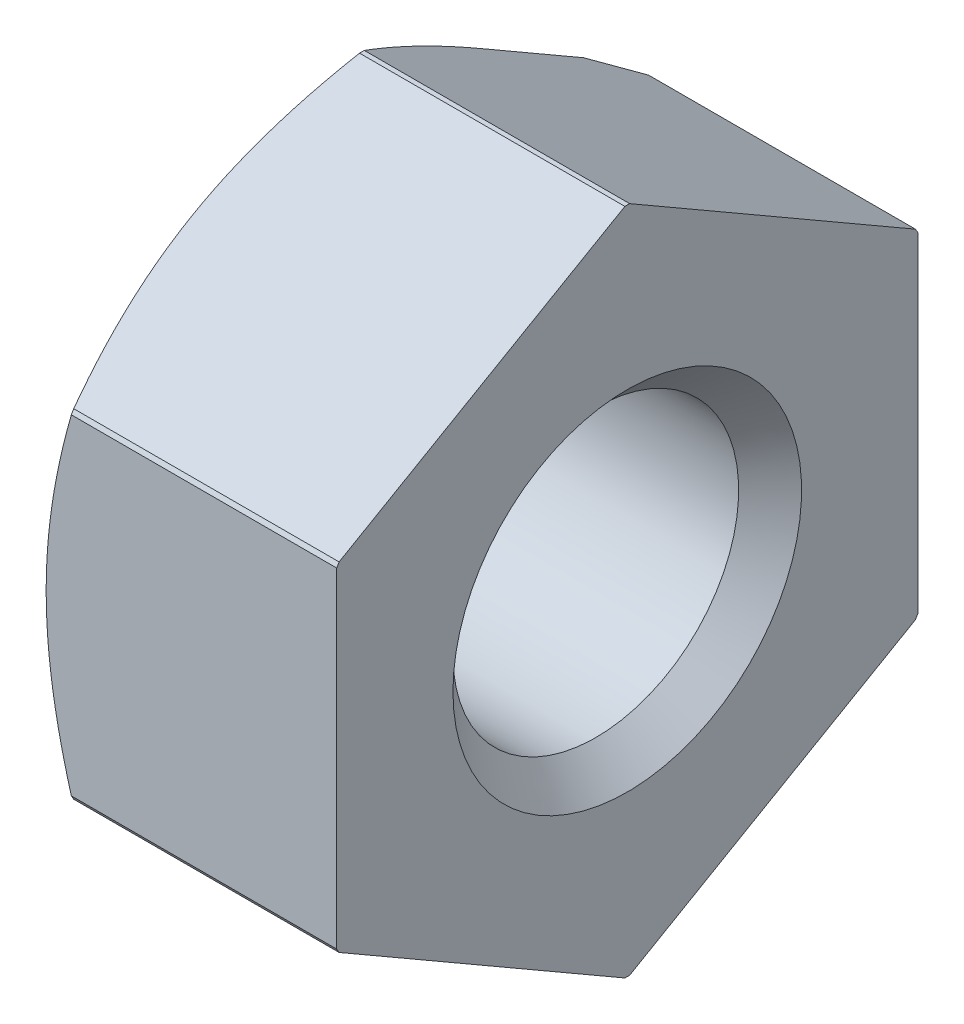
ISO-10303-21;
HEADER;
FILE_DESCRIPTION(('STEP AP214'),'2;1');
FILE_NAME('part.step','',(''),(''),'','','');
FILE_SCHEMA(('AUTOMOTIVE_DESIGN { 1 0 10303 214 1 1 1 1 }'));
ENDSEC;
DATA;
#1=APPLICATION_CONTEXT('core data for automotive mechanical design processes');
#2=APPLICATION_PROTOCOL_DEFINITION('international standard','automotive_design',2000,#1);
#3=PRODUCT_CONTEXT('',#1,'mechanical');
#4=PRODUCT('Part','Part','',(#3));
#5=PRODUCT_RELATED_PRODUCT_CATEGORY('part','',(#4));
#6=PRODUCT_DEFINITION_FORMATION('','',#4);
#7=PRODUCT_DEFINITION_CONTEXT('part definition',#1,'design');
#8=PRODUCT_DEFINITION('design','',#6,#7);
#9=PRODUCT_DEFINITION_SHAPE('','',#8);
#10=(LENGTH_UNIT() NAMED_UNIT(*) SI_UNIT(.MILLI.,.METRE.));
#11=(NAMED_UNIT(*) PLANE_ANGLE_UNIT() SI_UNIT($,.RADIAN.));
#12=(NAMED_UNIT(*) SI_UNIT($,.STERADIAN.) SOLID_ANGLE_UNIT());
#13=UNCERTAINTY_MEASURE_WITH_UNIT(LENGTH_MEASURE(1.E-05),#10,'distance_accuracy_value','');
#14=(GEOMETRIC_REPRESENTATION_CONTEXT(3) GLOBAL_UNCERTAINTY_ASSIGNED_CONTEXT((#13)) GLOBAL_UNIT_ASSIGNED_CONTEXT((#10,
#11,#12)) REPRESENTATION_CONTEXT('',''));
#15=CARTESIAN_POINT('',(0.,0.,0.));
#16=DIRECTION('',(0.,0.,1.));
#17=DIRECTION('',(1.,0.,0.));
#18=AXIS2_PLACEMENT_3D('',#15,#16,#17);
#19=CARTESIAN_POINT('',(2.5,0.,0.));
#20=DIRECTION('',(-1.,0.,0.));
#21=DIRECTION('',(0.,0.,1.));
#22=AXIS2_PLACEMENT_3D('',#19,#20,#21);
#23=CYLINDRICAL_SURFACE('',#22,5.75);
#24=DIRECTION('',(-1.,0.,0.));
#25=VECTOR('',#24,1.);
#26=CARTESIAN_POINT('',(2.5,-5.74985410537226,0.0409605533867544));
#27=LINE('',#26,#25);
#28=CARTESIAN_POINT('',(2.5,-5.74985410537226,0.0409605533867544));
#29=VERTEX_POINT('',#28);
#30=CARTESIAN_POINT('',(-2.06698729806814,-5.74985410537226,0.0409605533867544));
#31=VERTEX_POINT('',#30);
#32=EDGE_CURVE('E145',#29,#31,#27,.T.);
#33=ORIENTED_EDGE('',*,*,#32,.T.);
#34=CARTESIAN_POINT('',(-2.06698729806814,0.,0.));
#35=DIRECTION('',(-1.,0.,0.));
#36=DIRECTION('',(0.,0.,1.));
#37=AXIS2_PLACEMENT_3D('',#34,#35,#36);
#38=CIRCLE('',#37,5.75);
#39=CARTESIAN_POINT('',(-2.06698729806814,-5.74985410537226,-0.0409605533867514));
#40=VERTEX_POINT('',#39);
#41=EDGE_CURVE('E583',#31,#40,#38,.F.);
#42=ORIENTED_EDGE('',*,*,#41,.T.);
#43=DIRECTION('',(-1.,0.,0.));
#44=VECTOR('',#43,1.);
#45=CARTESIAN_POINT('',(2.5,-5.74985410537226,-0.0409605533867514));
#46=LINE('',#45,#44);
#47=CARTESIAN_POINT('',(2.5,-5.74985410537226,-0.0409605533867514));
#48=VERTEX_POINT('',#47);
#49=EDGE_CURVE('E170',#48,#40,#46,.T.);
#50=ORIENTED_EDGE('',*,*,#49,.F.);
#51=CARTESIAN_POINT('',(2.5,0.,0.));
#52=DIRECTION('',(-1.,0.,0.));
#53=DIRECTION('',(0.,0.,1.));
#54=AXIS2_PLACEMENT_3D('',#51,#52,#53);
#55=CIRCLE('',#54,5.75);
#56=EDGE_CURVE('E163',#48,#29,#55,.T.);
#57=ORIENTED_EDGE('',*,*,#56,.T.);
#58=EDGE_LOOP('',(#33,#42,#50,#57));
#59=FACE_BOUND('',#58,.T.);
#60=ADVANCED_FACE('F34',(#59),#23,.T.);
#61=CARTESIAN_POINT('',(2.5,-2.91039993247213,-4.95903944661325));
#62=DIRECTION('',(0.,-0.866025403784439,-0.5));
#63=DIRECTION('',(0.,0.5,-0.866025403784439));
#64=AXIS2_PLACEMENT_3D('',#61,#62,#63);
#65=PLANE('',#64);
#66=ORIENTED_EDGE('',*,*,#49,.T.);
#67=CARTESIAN_POINT('',(-2.06698729806814,-5.74985410537226,-0.0409605533867514));
#68=CARTESIAN_POINT('',(-2.13293926760584,-5.63422830061158,-0.241230321898287));
#69=CARTESIAN_POINT('',(-2.1932936171313,-5.51769112685617,-0.443078627813147));
#70=CARTESIAN_POINT('',(-2.29964864457212,-5.28360943261849,-0.848520015354616));
#71=CARTESIAN_POINT('',(-2.34571867458539,-5.16607271946542,-1.05209957429037));
#72=CARTESIAN_POINT('',(-2.4022437103581,-4.98869063027668,-1.35933436511798));
#73=CARTESIAN_POINT('',(-2.41899522891897,-4.92934645363163,-1.46212149420056));
#74=CARTESIAN_POINT('',(-2.44798386711932,-4.81038233656533,-1.66817338923695));
#75=CARTESIAN_POINT('',(-2.46022109462101,-4.75076240276736,-1.77143814371893));
#76=CARTESIAN_POINT('',(-2.47997267715725,-4.6310314761332,-1.97881819188661));
#77=CARTESIAN_POINT('',(-2.48746357893235,-4.57091950891741,-2.08293517324727));
#78=CARTESIAN_POINT('',(-2.49748725573861,-4.45058161989342,-2.2913665111124));
#79=CARTESIAN_POINT('',(-2.50001911227568,-4.39035567904276,-2.39568090059938));
#80=CARTESIAN_POINT('',(-2.49999999997852,-4.33012701891913,-2.5000000000053));
#81=B_SPLINE_CURVE_WITH_KNOTS('',3,(#67,#68,#69,#70,#71,#72,#73,#74,#75,#76,#77,#78,#79,#80),
.UNSPECIFIED.,.F.,.F.,(4,2,2,2,2,2,4),(0.,0.721695148162265,1.43982943305717,1.79934484275083,
2.15885166180701,2.52012135362396,2.88145795201162),.UNSPECIFIED.);
#82=CARTESIAN_POINT('',(-2.5,-4.33012701892219,-2.5));
#83=VERTEX_POINT('',#82);
#84=EDGE_CURVE('E317',#40,#83,#81,.T.);
#85=ORIENTED_EDGE('',*,*,#84,.T.);
#86=CARTESIAN_POINT('',(-2.5,-4.33012701888997,-2.4999999999814));
#87=CARTESIAN_POINT('',(-2.50001911228332,-4.26989835878741,-2.60431909939853));
#88=CARTESIAN_POINT('',(-2.49748725574054,-4.20967241794555,-2.70863348888983));
#89=CARTESIAN_POINT('',(-2.48746357893007,-4.08933452892827,-2.91706482675766));
#90=CARTESIAN_POINT('',(-2.47997267715647,-4.02922256171039,-3.02118180811669));
#91=CARTESIAN_POINT('',(-2.4602210946213,-3.90949163507487,-3.2285618562829));
#92=CARTESIAN_POINT('',(-2.4479838671192,-3.84987170127761,-3.33182661076503));
#93=CARTESIAN_POINT('',(-2.41899522891855,-3.73090758421201,-3.53787850580126));
#94=CARTESIAN_POINT('',(-2.40224371035779,-3.67156340756695,-3.64066563488352));
#95=CARTESIAN_POINT('',(-2.34571867458525,-3.49418131837815,-3.94790042571067));
#96=CARTESIAN_POINT('',(-2.29964864457193,-3.37664460522522,-4.15147998464637));
#97=CARTESIAN_POINT('',(-2.19329361713106,-3.14256291098795,-4.55692137218752));
#98=CARTESIAN_POINT('',(-2.13293926760562,-3.0260257372328,-4.75876967810211));
#99=CARTESIAN_POINT('',(-2.06698729806814,-2.91039993247213,-4.95903944661325));
#100=B_SPLINE_CURVE_WITH_KNOTS('',3,(#86,#87,#88,#89,#90,#91,#92,#93,#94,#95,#96,#97,#98,#99),
.UNSPECIFIED.,.F.,.F.,(4,2,2,2,2,2,4),(0.,0.361336598386039,0.72260629020182,1.08211310925735,
1.44162851895021,2.15976280384478,2.88145795200594),.UNSPECIFIED.);
#101=CARTESIAN_POINT('',(-2.06698729806814,-2.91039993247213,-4.95903944661325));
#102=VERTEX_POINT('',#101);
#103=EDGE_CURVE('E324',#83,#102,#100,.T.);
#104=ORIENTED_EDGE('',*,*,#103,.T.);
#105=DIRECTION('',(-1.,0.,0.));
#106=VECTOR('',#105,1.);
#107=CARTESIAN_POINT('',(2.5,-2.91039993247213,-4.95903944661325));
#108=LINE('',#107,#106);
#109=CARTESIAN_POINT('',(2.5,-2.91039993247213,-4.95903944661325));
#110=VERTEX_POINT('',#109);
#111=EDGE_CURVE('E205',#110,#102,#108,.T.);
#112=ORIENTED_EDGE('',*,*,#111,.F.);
#113=DIRECTION('',(0.,-0.5,0.866025403784439));
#114=VECTOR('',#113,1.);
#115=CARTESIAN_POINT('',(2.5,-2.91039993247213,-4.95903944661325));
#116=LINE('',#115,#114);
#117=EDGE_CURVE('E156',#110,#48,#116,.T.);
#118=ORIENTED_EDGE('',*,*,#117,.T.);
#119=EDGE_LOOP('',(#66,#85,#104,#112,#118));
#120=FACE_BOUND('',#119,.T.);
#121=ADVANCED_FACE('F299',(#120),#65,.T.);
#122=CARTESIAN_POINT('',(2.5,0.,0.));
#123=DIRECTION('',(-1.,0.,0.));
#124=DIRECTION('',(0.,0.,1.));
#125=AXIS2_PLACEMENT_3D('',#122,#123,#124);
#126=CYLINDRICAL_SURFACE('',#125,5.75);
#127=ORIENTED_EDGE('',*,*,#111,.T.);
#128=CARTESIAN_POINT('',(-2.06698729806814,0.,0.));
#129=DIRECTION('',(-1.,0.,0.));
#130=DIRECTION('',(0.,0.,1.));
#131=AXIS2_PLACEMENT_3D('',#128,#129,#130);
#132=CIRCLE('',#131,5.75);
#133=CARTESIAN_POINT('',(-2.06698729806814,-2.83945417290014,-5.));
#134=VERTEX_POINT('',#133);
#135=EDGE_CURVE('E389',#102,#134,#132,.F.);
#136=ORIENTED_EDGE('',*,*,#135,.T.);
#137=DIRECTION('',(-1.,0.,0.));
#138=VECTOR('',#137,1.);
#139=CARTESIAN_POINT('',(2.5,-2.83945417290014,-5.));
#140=LINE('',#139,#138);
#141=CARTESIAN_POINT('',(2.5,-2.83945417290014,-5.));
#142=VERTEX_POINT('',#141);
#143=EDGE_CURVE('E208',#142,#134,#140,.T.);
#144=ORIENTED_EDGE('',*,*,#143,.F.);
#145=CARTESIAN_POINT('',(2.5,0.,0.));
#146=DIRECTION('',(-1.,0.,0.));
#147=DIRECTION('',(0.,0.,1.));
#148=AXIS2_PLACEMENT_3D('',#145,#146,#147);
#149=CIRCLE('',#148,5.75);
#150=EDGE_CURVE('E199',#142,#110,#149,.T.);
#151=ORIENTED_EDGE('',*,*,#150,.T.);
#152=EDGE_LOOP('',(#127,#136,#144,#151));
#153=FACE_BOUND('',#152,.T.);
#154=ADVANCED_FACE('F303',(#153),#126,.T.);
#155=CARTESIAN_POINT('',(2.5,2.83945417290014,-5.));
#156=DIRECTION('',(0.,0.,-1.));
#157=DIRECTION('',(-1.,0.,0.));
#158=AXIS2_PLACEMENT_3D('',#155,#156,#157);
#159=PLANE('',#158);
#160=ORIENTED_EDGE('',*,*,#143,.T.);
#161=DIRECTION('',(0.,1.,0.));
#162=VECTOR('',#161,1.);
#163=CARTESIAN_POINT('',(-2.06698729806814,2.83945417290014,-5.));
#164=LINE('',#163,#162);
#165=CARTESIAN_POINT('',(-2.06698729806814,2.83945417290014,-5.));
#166=VERTEX_POINT('',#165);
#167=EDGE_CURVE('E386',#134,#166,#164,.T.);
#168=ORIENTED_EDGE('',*,*,#167,.T.);
#169=DIRECTION('',(-1.,0.,0.));
#170=VECTOR('',#169,1.);
#171=CARTESIAN_POINT('',(2.5,2.83945417290014,-5.));
#172=LINE('',#171,#170);
#173=CARTESIAN_POINT('',(2.5,2.83945417290014,-5.));
#174=VERTEX_POINT('',#173);
#175=EDGE_CURVE('E211',#174,#166,#172,.T.);
#176=ORIENTED_EDGE('',*,*,#175,.F.);
#177=DIRECTION('',(0.,-1.,0.));
#178=VECTOR('',#177,1.);
#179=CARTESIAN_POINT('',(2.5,2.83945417290014,-5.));
#180=LINE('',#179,#178);
#181=EDGE_CURVE('E196',#174,#142,#180,.T.);
#182=ORIENTED_EDGE('',*,*,#181,.T.);
#183=EDGE_LOOP('',(#160,#168,#176,#182));
#184=FACE_BOUND('',#183,.T.);
#185=ADVANCED_FACE('F337',(#184),#159,.T.);
#186=CARTESIAN_POINT('',(2.5,0.,0.));
#187=DIRECTION('',(-1.,0.,0.));
#188=DIRECTION('',(0.,0.,1.));
#189=AXIS2_PLACEMENT_3D('',#186,#187,#188);
#190=CYLINDRICAL_SURFACE('',#189,5.75);
#191=ORIENTED_EDGE('',*,*,#175,.T.);
#192=CARTESIAN_POINT('',(-4.95373864413737,0.,0.));
#193=DIRECTION('',(0.866025403775356,0.,0.500000000015732));
#194=DIRECTION('',(-0.500000000015732,0.,0.866025403775356));
#195=AXIS2_PLACEMENT_3D('',#192,#193,#194);
#196=ELLIPSE('',#195,6.63952809575033,5.75);
#197=CARTESIAN_POINT('',(-2.09063588459313,2.91039993247213,-4.95903944661325));
#198=VERTEX_POINT('',#197);
#199=EDGE_CURVE('E387',#166,#198,#196,.T.);
#200=ORIENTED_EDGE('',*,*,#199,.T.);
#201=DIRECTION('',(-1.,0.,0.));
#202=VECTOR('',#201,1.);
#203=CARTESIAN_POINT('',(2.5,2.91039993247213,-4.95903944661325));
#204=LINE('',#203,#202);
#205=CARTESIAN_POINT('',(2.5,2.91039993247213,-4.95903944661325));
#206=VERTEX_POINT('',#205);
#207=EDGE_CURVE('E214',#206,#198,#204,.T.);
#208=ORIENTED_EDGE('',*,*,#207,.F.);
#209=CARTESIAN_POINT('',(2.5,0.,0.));
#210=DIRECTION('',(-1.,0.,0.));
#211=DIRECTION('',(0.,0.,1.));
#212=AXIS2_PLACEMENT_3D('',#209,#210,#211);
#213=CIRCLE('',#212,5.75);
#214=EDGE_CURVE('E193',#206,#174,#213,.T.);
#215=ORIENTED_EDGE('',*,*,#214,.T.);
#216=EDGE_LOOP('',(#191,#200,#208,#215));
#217=FACE_BOUND('',#216,.T.);
#218=ADVANCED_FACE('F341',(#217),#190,.T.);
#219=CARTESIAN_POINT('',(2.5,5.74985410537226,-0.0409605533867555));
#220=DIRECTION('',(0.,0.866025403784439,-0.5));
#221=DIRECTION('',(0.,0.5,0.866025403784439));
#222=AXIS2_PLACEMENT_3D('',#219,#220,#221);
#223=PLANE('',#222);
#224=DIRECTION('',(0.,-0.5,-0.866025403784439));
#225=VECTOR('',#224,1.);
#226=CARTESIAN_POINT('',(-2.5,5.74985410537226,-0.0409605533867555));
#227=LINE('',#226,#225);
#228=CARTESIAN_POINT('',(-2.5,4.3301270189222,-2.5));
#229=VERTEX_POINT('',#228);
#230=CARTESIAN_POINT('',(-2.5,3.31976404786183,-4.2499999999628));
#231=VERTEX_POINT('',#230);
#232=EDGE_CURVE('E171',#229,#231,#227,.T.);
#233=ORIENTED_EDGE('',*,*,#232,.F.);
#234=CARTESIAN_POINT('',(-2.5,4.33012701888998,-2.4999999999814));
#235=CARTESIAN_POINT('',(-2.50001911228332,4.39035567903384,-2.39568090058812));
#236=CARTESIAN_POINT('',(-2.49748725574054,4.45058161989264,-2.29136651110659));
#237=CARTESIAN_POINT('',(-2.48746357893007,4.57091950892232,-2.08293517324592));
#238=CARTESIAN_POINT('',(-2.47997267715647,4.63103147613566,-1.97881819188427));
#239=CARTESIAN_POINT('',(-2.4602210946213,4.75076240276787,-1.77143814371614));
#240=CARTESIAN_POINT('',(-2.4479838671192,4.81038233656633,-1.66817338923471));
#241=CARTESIAN_POINT('',(-2.41899522891855,4.92934645363283,-1.462121494199));
#242=CARTESIAN_POINT('',(-2.40224371035779,4.98869063027761,-1.35933436511658));
#243=CARTESIAN_POINT('',(-2.34571867458525,5.16607271946591,-1.05209957428915));
#244=CARTESIAN_POINT('',(-2.29964864457193,5.283609432619,-0.848520015353538));
#245=CARTESIAN_POINT('',(-2.19329361713106,5.51769112685661,-0.443078627812578));
#246=CARTESIAN_POINT('',(-2.13293926760562,5.63422830061193,-0.241230321898081));
#247=CARTESIAN_POINT('',(-2.06698729806814,5.74985410537226,-0.0409605533867552));
#248=B_SPLINE_CURVE_WITH_KNOTS('',3,(#234,#235,#236,#237,#238,#239,#240,#241,#242,#243,#244,
#245,#246,#247),.UNSPECIFIED.,.F.,.F.,(4,2,2,2,2,2,4),(0.,0.361336598386038,0.722606290201819,
1.08211310925735,1.44162851895021,2.15976280384478,2.88145795200594),.UNSPECIFIED.);
#249=CARTESIAN_POINT('',(-2.06698729806814,5.74985410537226,-0.0409605533867554));
#250=VERTEX_POINT('',#249);
#251=EDGE_CURVE('E352',#229,#250,#248,.T.);
#252=ORIENTED_EDGE('',*,*,#251,.T.);
#253=DIRECTION('',(-1.,0.,0.));
#254=VECTOR('',#253,1.);
#255=CARTESIAN_POINT('',(2.5,5.74985410537226,-0.0409605533867554));
#256=LINE('',#255,#254);
#257=CARTESIAN_POINT('',(2.5,5.74985410537226,-0.0409605533867554));
#258=VERTEX_POINT('',#257);
#259=EDGE_CURVE('E217',#258,#250,#256,.T.);
#260=ORIENTED_EDGE('',*,*,#259,.F.);
#261=DIRECTION('',(0.,-0.5,-0.866025403784439));
#262=VECTOR('',#261,1.);
#263=CARTESIAN_POINT('',(2.5,5.74985410537226,-0.0409605533867555));
#264=LINE('',#263,#262);
#265=EDGE_CURVE('E190',#258,#206,#264,.T.);
#266=ORIENTED_EDGE('',*,*,#265,.T.);
#267=ORIENTED_EDGE('',*,*,#207,.T.);
#268=DIRECTION('',(0.447213595514967,-0.447213595496206,-0.774596669234984));
#269=VECTOR('',#268,1.);
#270=CARTESIAN_POINT('',(-3.44407204599016,4.26383609381238,-2.61481925037094));
#271=LINE('',#270,#269);
#272=EDGE_CURVE('E323',#198,#231,#271,.F.);
#273=ORIENTED_EDGE('',*,*,#272,.T.);
#274=EDGE_LOOP('',(#233,#252,#260,#266,#267,#273));
#275=FACE_BOUND('',#274,.T.);
#276=ADVANCED_FACE('F345',(#275),#223,.T.);
#277=CARTESIAN_POINT('',(2.5,0.,0.));
#278=DIRECTION('',(-1.,0.,0.));
#279=DIRECTION('',(0.,0.,1.));
#280=AXIS2_PLACEMENT_3D('',#277,#278,#279);
#281=CYLINDRICAL_SURFACE('',#280,5.75);
#282=ORIENTED_EDGE('',*,*,#259,.T.);
#283=CARTESIAN_POINT('',(-2.06698729806814,0.,0.));
#284=DIRECTION('',(-1.,0.,0.));
#285=DIRECTION('',(0.,0.,1.));
#286=AXIS2_PLACEMENT_3D('',#283,#284,#285);
#287=CIRCLE('',#286,5.75);
#288=CARTESIAN_POINT('',(-2.06698729806814,5.74985410537226,0.0409605533867514));
#289=VERTEX_POINT('',#288);
#290=EDGE_CURVE('E357',#250,#289,#287,.F.);
#291=ORIENTED_EDGE('',*,*,#290,.T.);
#292=DIRECTION('',(-1.,0.,0.));
#293=VECTOR('',#292,1.);
#294=CARTESIAN_POINT('',(2.5,5.74985410537226,0.0409605533867514));
#295=LINE('',#294,#293);
#296=CARTESIAN_POINT('',(2.5,5.74985410537226,0.0409605533867514));
#297=VERTEX_POINT('',#296);
#298=EDGE_CURVE('E220',#297,#289,#295,.T.);
#299=ORIENTED_EDGE('',*,*,#298,.F.);
#300=CARTESIAN_POINT('',(2.5,0.,0.));
#301=DIRECTION('',(-1.,0.,0.));
#302=DIRECTION('',(0.,0.,1.));
#303=AXIS2_PLACEMENT_3D('',#300,#301,#302);
#304=CIRCLE('',#303,5.75);
#305=EDGE_CURVE('E187',#297,#258,#304,.T.);
#306=ORIENTED_EDGE('',*,*,#305,.T.);
#307=EDGE_LOOP('',(#282,#291,#299,#306));
#308=FACE_BOUND('',#307,.T.);
#309=ADVANCED_FACE('F350',(#308),#281,.T.);
#310=CARTESIAN_POINT('',(2.5,2.91039993247213,4.95903944661325));
#311=DIRECTION('',(0.,0.866025403784439,0.5));
#312=DIRECTION('',(0.,-0.5,0.866025403784439));
#313=AXIS2_PLACEMENT_3D('',#310,#311,#312);
#314=PLANE('',#313);
#315=ORIENTED_EDGE('',*,*,#298,.T.);
#316=CARTESIAN_POINT('',(-2.06698729806814,5.74985410537226,0.0409605533867514));
#317=CARTESIAN_POINT('',(-2.13293926760584,5.63422830061158,0.241230321898288));
#318=CARTESIAN_POINT('',(-2.1932936171313,5.51769112685617,0.443078627813147));
#319=CARTESIAN_POINT('',(-2.29964864457212,5.28360943261849,0.848520015354617));
#320=CARTESIAN_POINT('',(-2.34571867458539,5.16607271946542,1.05209957429037));
#321=CARTESIAN_POINT('',(-2.4022437103581,4.98869063027668,1.35933436511799));
#322=CARTESIAN_POINT('',(-2.41899522891897,4.92934645363163,1.46212149420056));
#323=CARTESIAN_POINT('',(-2.44798386711932,4.81038233656533,1.66817338923695));
#324=CARTESIAN_POINT('',(-2.46022109462101,4.75076240276736,1.77143814371893));
#325=CARTESIAN_POINT('',(-2.47997267715725,4.6310314761332,1.97881819188661));
#326=CARTESIAN_POINT('',(-2.48746357893235,4.57091950891741,2.08293517324727));
#327=CARTESIAN_POINT('',(-2.49748725573861,4.45058161989342,2.2913665111124));
#328=CARTESIAN_POINT('',(-2.50001911227568,4.39035567904276,2.39568090059938));
#329=CARTESIAN_POINT('',(-2.49999999997852,4.33012701891913,2.5000000000053));
#330=B_SPLINE_CURVE_WITH_KNOTS('',3,(#316,#317,#318,#319,#320,#321,#322,#323,#324,#325,#326,
#327,#328,#329),.UNSPECIFIED.,.F.,.F.,(4,2,2,2,2,2,4),(0.,0.721695148162266,1.43982943305717,
1.79934484275083,2.15885166180701,2.52012135362396,2.88145795201162),.UNSPECIFIED.);
#331=CARTESIAN_POINT('',(-2.5,4.33012701892219,2.5));
#332=VERTEX_POINT('',#331);
#333=EDGE_CURVE('E364',#289,#332,#330,.T.);
#334=ORIENTED_EDGE('',*,*,#333,.T.);
#335=CARTESIAN_POINT('',(-2.5,4.33012701888998,2.4999999999814));
#336=CARTESIAN_POINT('',(-2.50001911228332,4.26989835878741,2.60431909939853));
#337=CARTESIAN_POINT('',(-2.49748725574054,4.20967241794555,2.70863348888983));
#338=CARTESIAN_POINT('',(-2.48746357893008,4.08933452892827,2.91706482675766));
#339=CARTESIAN_POINT('',(-2.47997267715647,4.02922256171039,3.02118180811669));
#340=CARTESIAN_POINT('',(-2.46022109462131,3.90949163507487,3.2285618562829));
#341=CARTESIAN_POINT('',(-2.4479838671192,3.84987170127761,3.33182661076503));
#342=CARTESIAN_POINT('',(-2.41899522891855,3.73090758421201,3.53787850580126));
#343=CARTESIAN_POINT('',(-2.40224371035779,3.67156340756695,3.64066563488352));
#344=CARTESIAN_POINT('',(-2.34571867458525,3.49418131837815,3.94790042571067));
#345=CARTESIAN_POINT('',(-2.29964864457193,3.37664460522522,4.15147998464637));
#346=CARTESIAN_POINT('',(-2.19329361713106,3.14256291098795,4.55692137218752));
#347=CARTESIAN_POINT('',(-2.13293926760562,3.0260257372328,4.75876967810211));
#348=CARTESIAN_POINT('',(-2.06698729806814,2.91039993247213,4.95903944661325));
#349=B_SPLINE_CURVE_WITH_KNOTS('',3,(#335,#336,#337,#338,#339,#340,#341,#342,#343,#344,#345,
#346,#347,#348),.UNSPECIFIED.,.F.,.F.,(4,2,2,2,2,2,4),(0.,0.361336598386039,0.722606290201819,
1.08211310925735,1.44162851895021,2.15976280384478,2.88145795200594),.UNSPECIFIED.);
#350=CARTESIAN_POINT('',(-2.06698729806814,2.91039993247213,4.95903944661325));
#351=VERTEX_POINT('',#350);
#352=EDGE_CURVE('E359',#332,#351,#349,.T.);
#353=ORIENTED_EDGE('',*,*,#352,.T.);
#354=DIRECTION('',(-1.,0.,0.));
#355=VECTOR('',#354,1.);
#356=CARTESIAN_POINT('',(2.5,2.91039993247213,4.95903944661325));
#357=LINE('',#356,#355);
#358=CARTESIAN_POINT('',(2.5,2.91039993247213,4.95903944661325));
#359=VERTEX_POINT('',#358);
#360=EDGE_CURVE('E223',#359,#351,#357,.T.);
#361=ORIENTED_EDGE('',*,*,#360,.F.);
#362=DIRECTION('',(0.,0.5,-0.866025403784439));
#363=VECTOR('',#362,1.);
#364=CARTESIAN_POINT('',(2.5,2.91039993247213,4.95903944661325));
#365=LINE('',#364,#363);
#366=EDGE_CURVE('E184',#359,#297,#365,.T.);
#367=ORIENTED_EDGE('',*,*,#366,.T.);
#368=EDGE_LOOP('',(#315,#334,#353,#361,#367));
#369=FACE_BOUND('',#368,.T.);
#370=ADVANCED_FACE('F369',(#369),#314,.T.);
#371=CARTESIAN_POINT('',(2.5,0.,0.));
#372=DIRECTION('',(-1.,0.,0.));
#373=DIRECTION('',(0.,0.,1.));
#374=AXIS2_PLACEMENT_3D('',#371,#372,#373);
#375=CYLINDRICAL_SURFACE('',#374,5.75);
#376=ORIENTED_EDGE('',*,*,#360,.T.);
#377=CARTESIAN_POINT('',(-2.06698729806814,0.,0.));
#378=DIRECTION('',(-1.,0.,0.));
#379=DIRECTION('',(0.,0.,1.));
#380=AXIS2_PLACEMENT_3D('',#377,#378,#379);
#381=CIRCLE('',#380,5.75);
#382=CARTESIAN_POINT('',(-2.06698729806814,2.83945417290014,5.));
#383=VERTEX_POINT('',#382);
#384=EDGE_CURVE('E57',#351,#383,#381,.F.);
#385=ORIENTED_EDGE('',*,*,#384,.T.);
#386=DIRECTION('',(-1.,0.,0.));
#387=VECTOR('',#386,1.);
#388=CARTESIAN_POINT('',(2.5,2.83945417290014,5.));
#389=LINE('',#388,#387);
#390=CARTESIAN_POINT('',(2.5,2.83945417290014,5.));
#391=VERTEX_POINT('',#390);
#392=EDGE_CURVE('E225',#391,#383,#389,.T.);
#393=ORIENTED_EDGE('',*,*,#392,.F.);
#394=CARTESIAN_POINT('',(2.5,0.,0.));
#395=DIRECTION('',(-1.,0.,0.));
#396=DIRECTION('',(0.,0.,1.));
#397=AXIS2_PLACEMENT_3D('',#394,#395,#396);
#398=CIRCLE('',#397,5.75);
#399=EDGE_CURVE('E181',#391,#359,#398,.T.);
#400=ORIENTED_EDGE('',*,*,#399,.T.);
#401=EDGE_LOOP('',(#376,#385,#393,#400));
#402=FACE_BOUND('',#401,.T.);
#403=ADVANCED_FACE('F290',(#402),#375,.T.);
#404=CARTESIAN_POINT('',(2.5,-2.83945417290014,5.));
#405=DIRECTION('',(0.,0.,1.));
#406=DIRECTION('',(1.,0.,0.));
#407=AXIS2_PLACEMENT_3D('',#404,#405,#406);
#408=PLANE('',#407);
#409=ORIENTED_EDGE('',*,*,#392,.T.);
#410=CARTESIAN_POINT('',(-2.06698729806814,2.83945417290014,5.));
#411=CARTESIAN_POINT('',(-2.13293926760584,2.60820256337878,5.));
#412=CARTESIAN_POINT('',(-2.1932936171313,2.37512821586795,5.));
#413=CARTESIAN_POINT('',(-2.29964864457212,1.90696482739258,5.));
#414=CARTESIAN_POINT('',(-2.34571867458539,1.67189140108646,5.));
#415=CARTESIAN_POINT('',(-2.4022437103581,1.31712722270897,5.));
#416=CARTESIAN_POINT('',(-2.41899522891897,1.19843886941887,5.));
#417=CARTESIAN_POINT('',(-2.44798386711932,0.96051063528628,5.));
#418=CARTESIAN_POINT('',(-2.46022109462101,0.841270767690336,5.));
#419=CARTESIAN_POINT('',(-2.47997267715725,0.601808914422007,5.));
#420=CARTESIAN_POINT('',(-2.48746357893235,0.48158497999043,5.));
#421=CARTESIAN_POINT('',(-2.49748725573861,0.240909201942455,5.));
#422=CARTESIAN_POINT('',(-2.50001911227568,0.120457320241133,5.));
#423=CARTESIAN_POINT('',(-2.49999999997852,-6.12260015220317E-12,5.));
#424=B_SPLINE_CURVE_WITH_KNOTS('',3,(#410,#411,#412,#413,#414,#415,#416,#417,#418,#419,#420,
#421,#422,#423),.UNSPECIFIED.,.F.,.F.,(4,2,2,2,2,2,4),(0.,0.721695148162265,1.43982943305717,
1.79934484275083,2.15885166180701,2.52012135362396,2.88145795201162),.UNSPECIFIED.);
#425=CARTESIAN_POINT('',(-2.5,0.,5.));
#426=VERTEX_POINT('',#425);
#427=EDGE_CURVE('E279',#383,#426,#424,.T.);
#428=ORIENTED_EDGE('',*,*,#427,.T.);
#429=CARTESIAN_POINT('',(-2.5,0.,4.9999999999628));
#430=CARTESIAN_POINT('',(-2.50001911228332,-0.12045732024643,4.99999999998664));
#431=CARTESIAN_POINT('',(-2.49748725574054,-0.240909201947093,4.99999999999642));
#432=CARTESIAN_POINT('',(-2.48746357893008,-0.48158497999405,5.00000000000358));
#433=CARTESIAN_POINT('',(-2.47997267715647,-0.601808914425265,5.00000000000096));
#434=CARTESIAN_POINT('',(-2.46022109462131,-0.841270767693007,4.99999999999905));
#435=CARTESIAN_POINT('',(-2.44798386711921,-0.960510635288724,4.99999999999974));
#436=CARTESIAN_POINT('',(-2.41899522891855,-1.19843886942082,5.00000000000026));
#437=CARTESIAN_POINT('',(-2.40224371035779,-1.31712722271066,5.0000000000001));
#438=CARTESIAN_POINT('',(-2.34571867458525,-1.67189140108776,4.99999999999981));
#439=CARTESIAN_POINT('',(-2.29964864457193,-1.90696482739378,4.9999999999999));
#440=CARTESIAN_POINT('',(-2.19329361713106,-2.37512821586866,5.0000000000001));
#441=CARTESIAN_POINT('',(-2.13293926760562,-2.60820256337913,5.00000000000019));
#442=CARTESIAN_POINT('',(-2.06698729806814,-2.83945417290014,5.));
#443=B_SPLINE_CURVE_WITH_KNOTS('',3,(#429,#430,#431,#432,#433,#434,#435,#436,#437,#438,#439,
#440,#441,#442),.UNSPECIFIED.,.F.,.F.,(4,2,2,2,2,2,4),(0.,0.361336598386039,0.72260629020182,
1.08211310925735,1.44162851895021,2.15976280384478,2.88145795200594),.UNSPECIFIED.);
#444=CARTESIAN_POINT('',(-2.06698729806814,-2.83945417290014,5.));
#445=VERTEX_POINT('',#444);
#446=EDGE_CURVE('E49',#426,#445,#443,.T.);
#447=ORIENTED_EDGE('',*,*,#446,.T.);
#448=DIRECTION('',(-1.,0.,0.));
#449=VECTOR('',#448,1.);
#450=CARTESIAN_POINT('',(2.5,-2.83945417290014,5.));
#451=LINE('',#450,#449);
#452=CARTESIAN_POINT('',(2.5,-2.83945417290014,5.));
#453=VERTEX_POINT('',#452);
#454=EDGE_CURVE('E227',#453,#445,#451,.T.);
#455=ORIENTED_EDGE('',*,*,#454,.F.);
#456=DIRECTION('',(0.,1.,0.));
#457=VECTOR('',#456,1.);
#458=CARTESIAN_POINT('',(2.5,-2.83945417290014,5.));
#459=LINE('',#458,#457);
#460=EDGE_CURVE('E178',#453,#391,#459,.T.);
#461=ORIENTED_EDGE('',*,*,#460,.T.);
#462=EDGE_LOOP('',(#409,#428,#447,#455,#461));
#463=FACE_BOUND('',#462,.T.);
#464=ADVANCED_FACE('F285',(#463),#408,.T.);
#465=CARTESIAN_POINT('',(2.5,0.,0.));
#466=DIRECTION('',(-1.,0.,0.));
#467=DIRECTION('',(0.,0.,1.));
#468=AXIS2_PLACEMENT_3D('',#465,#466,#467);
#469=CYLINDRICAL_SURFACE('',#468,5.75);
#470=ORIENTED_EDGE('',*,*,#454,.T.);
#471=CARTESIAN_POINT('',(-2.06698729806814,0.,0.));
#472=DIRECTION('',(-1.,0.,0.));
#473=DIRECTION('',(0.,0.,1.));
#474=AXIS2_PLACEMENT_3D('',#471,#472,#473);
#475=CIRCLE('',#474,5.75);
#476=CARTESIAN_POINT('',(-2.06698729806814,-2.91039993247213,4.95903944661325));
#477=VERTEX_POINT('',#476);
#478=EDGE_CURVE('E409',#445,#477,#475,.F.);
#479=ORIENTED_EDGE('',*,*,#478,.T.);
#480=DIRECTION('',(-1.,0.,0.));
#481=VECTOR('',#480,1.);
#482=CARTESIAN_POINT('',(2.5,-2.91039993247213,4.95903944661325));
#483=LINE('',#482,#481);
#484=CARTESIAN_POINT('',(2.5,-2.91039993247213,4.95903944661325));
#485=VERTEX_POINT('',#484);
#486=EDGE_CURVE('E155',#485,#477,#483,.T.);
#487=ORIENTED_EDGE('',*,*,#486,.F.);
#488=CARTESIAN_POINT('',(2.5,0.,0.));
#489=DIRECTION('',(-1.,0.,0.));
#490=DIRECTION('',(0.,0.,1.));
#491=AXIS2_PLACEMENT_3D('',#488,#489,#490);
#492=CIRCLE('',#491,5.75);
#493=EDGE_CURVE('E167',#485,#453,#492,.T.);
#494=ORIENTED_EDGE('',*,*,#493,.T.);
#495=EDGE_LOOP('',(#470,#479,#487,#494));
#496=FACE_BOUND('',#495,.T.);
#497=ADVANCED_FACE('F289',(#496),#469,.T.);
#498=CARTESIAN_POINT('',(2.5,-5.74985410537226,0.0409605533867544));
#499=DIRECTION('',(0.,-0.866025403784439,0.5));
#500=DIRECTION('',(0.,-0.5,-0.866025403784439));
#501=AXIS2_PLACEMENT_3D('',#498,#499,#500);
#502=PLANE('',#501);
#503=CARTESIAN_POINT('',(-2.06698729806814,-2.91039993247213,4.95903944661325));
#504=CARTESIAN_POINT('',(-2.13293926760584,-3.02602573723281,4.75876967810171));
#505=CARTESIAN_POINT('',(-2.1932936171313,-3.14256291098822,4.55692137218685));
#506=CARTESIAN_POINT('',(-2.29964864457212,-3.37664460522591,4.15147998464538));
#507=CARTESIAN_POINT('',(-2.34571867458539,-3.49418131837897,3.94790042570963));
#508=CARTESIAN_POINT('',(-2.4022437103581,-3.67156340756771,3.64066563488201));
#509=CARTESIAN_POINT('',(-2.41899522891897,-3.73090758421276,3.53787850579944));
#510=CARTESIAN_POINT('',(-2.44798386711932,-3.84987170127906,3.33182661076305));
#511=CARTESIAN_POINT('',(-2.46022109462101,-3.90949163507703,3.22856185628107));
#512=CARTESIAN_POINT('',(-2.47997267715725,-4.02922256171119,3.02118180811339));
#513=CARTESIAN_POINT('',(-2.48746357893235,-4.08933452892698,2.91706482675273));
#514=CARTESIAN_POINT('',(-2.49748725573861,-4.20967241795097,2.7086334888876));
#515=CARTESIAN_POINT('',(-2.50001911227568,-4.26989835880163,2.60431909940062));
#516=CARTESIAN_POINT('',(-2.49999999997852,-4.33012701892526,2.4999999999947));
#517=B_SPLINE_CURVE_WITH_KNOTS('',3,(#503,#504,#505,#506,#507,#508,#509,#510,#511,#512,#513,
#514,#515,#516),.UNSPECIFIED.,.F.,.F.,(4,2,2,2,2,2,4),(0.,0.721695148162264,1.43982943305716,
1.79934484275083,2.158851661807,2.52012135362396,2.88145795201161),.UNSPECIFIED.);
#518=CARTESIAN_POINT('',(-2.5,-4.3301270189222,2.5));
#519=VERTEX_POINT('',#518);
#520=EDGE_CURVE('E247',#477,#519,#517,.T.);
#521=ORIENTED_EDGE('',*,*,#520,.T.);
#522=CARTESIAN_POINT('',(-2.5,-4.33012701888998,2.4999999999814));
#523=CARTESIAN_POINT('',(-2.50001911228332,-4.39035567903384,2.39568090058811));
#524=CARTESIAN_POINT('',(-2.49748725574054,-4.45058161989264,2.29136651110659));
#525=CARTESIAN_POINT('',(-2.48746357893007,-4.57091950892232,2.08293517324592));
#526=CARTESIAN_POINT('',(-2.47997267715647,-4.63103147613566,1.97881819188426));
#527=CARTESIAN_POINT('',(-2.4602210946213,-4.75076240276787,1.77143814371614));
#528=CARTESIAN_POINT('',(-2.4479838671192,-4.81038233656633,1.6681733892347));
#529=CARTESIAN_POINT('',(-2.41899522891855,-4.92934645363283,1.462121494199));
#530=CARTESIAN_POINT('',(-2.40224371035779,-4.98869063027761,1.35933436511657));
#531=CARTESIAN_POINT('',(-2.34571867458525,-5.16607271946591,1.05209957428914));
#532=CARTESIAN_POINT('',(-2.29964864457193,-5.283609432619,0.848520015353536));
#533=CARTESIAN_POINT('',(-2.19329361713106,-5.51769112685661,0.443078627812578));
#534=CARTESIAN_POINT('',(-2.13293926760562,-5.63422830061193,0.24123032189808));
#535=CARTESIAN_POINT('',(-2.06698729806814,-5.74985410537226,0.0409605533867542));
#536=B_SPLINE_CURVE_WITH_KNOTS('',3,(#522,#523,#524,#525,#526,#527,#528,#529,#530,#531,#532,
#533,#534,#535),.UNSPECIFIED.,.F.,.F.,(4,2,2,2,2,2,4),(0.,0.361336598386039,0.722606290201819,
1.08211310925735,1.44162851895021,2.15976280384478,2.88145795200594),.UNSPECIFIED.);
#537=EDGE_CURVE('E151',#519,#31,#536,.T.);
#538=ORIENTED_EDGE('',*,*,#537,.T.);
#539=ORIENTED_EDGE('',*,*,#32,.F.);
#540=DIRECTION('',(0.,0.5,0.866025403784439));
#541=VECTOR('',#540,1.);
#542=CARTESIAN_POINT('',(2.5,-5.74985410537226,0.0409605533867544));
#543=LINE('',#542,#541);
#544=EDGE_CURVE('E150',#29,#485,#543,.T.);
#545=ORIENTED_EDGE('',*,*,#544,.T.);
#546=ORIENTED_EDGE('',*,*,#486,.T.);
#547=EDGE_LOOP('',(#521,#538,#539,#545,#546));
#548=FACE_BOUND('',#547,.T.);
#549=ADVANCED_FACE('F148',(#548),#502,.T.);
#550=CARTESIAN_POINT('',(2.5,0.,0.));
#551=DIRECTION('',(-1.,0.,0.));
#552=DIRECTION('',(0.,0.,1.));
#553=AXIS2_PLACEMENT_3D('',#550,#551,#552);
#554=PLANE('',#553);
#555=CARTESIAN_POINT('',(2.5,0.,0.));
#556=DIRECTION('',(-1.,0.,0.));
#557=DIRECTION('',(0.,0.,1.));
#558=AXIS2_PLACEMENT_3D('',#555,#556,#557);
#559=CIRCLE('',#558,2.99999999999183);
#560=CARTESIAN_POINT('',(2.5,0.,2.99999999999183));
#561=VERTEX_POINT('',#560);
#562=EDGE_CURVE('E410',#561,#561,#559,.T.);
#563=ORIENTED_EDGE('',*,*,#562,.T.);
#564=EDGE_LOOP('',(#563));
#565=FACE_BOUND('',#564,.T.);
#566=ORIENTED_EDGE('',*,*,#56,.F.);
#567=ORIENTED_EDGE('',*,*,#117,.F.);
#568=ORIENTED_EDGE('',*,*,#150,.F.);
#569=ORIENTED_EDGE('',*,*,#181,.F.);
#570=ORIENTED_EDGE('',*,*,#214,.F.);
#571=ORIENTED_EDGE('',*,*,#265,.F.);
#572=ORIENTED_EDGE('',*,*,#305,.F.);
#573=ORIENTED_EDGE('',*,*,#366,.F.);
#574=ORIENTED_EDGE('',*,*,#399,.F.);
#575=ORIENTED_EDGE('',*,*,#460,.F.);
#576=ORIENTED_EDGE('',*,*,#493,.F.);
#577=ORIENTED_EDGE('',*,*,#544,.F.);
#578=EDGE_LOOP('',(#566,#567,#568,#569,#570,#571,#572,#573,#574,#575,#576,#577));
#579=FACE_BOUND('',#578,.T.);
#580=ADVANCED_FACE('F161',(#565,#579),#554,.F.);
#581=CARTESIAN_POINT('',(-2.5,0.,0.));
#582=DIRECTION('',(-1.,0.,0.));
#583=DIRECTION('',(0.,0.,1.));
#584=AXIS2_PLACEMENT_3D('',#581,#582,#583);
#585=PLANE('',#584);
#586=CARTESIAN_POINT('',(-2.5,0.,0.));
#587=DIRECTION('',(-1.,0.,0.));
#588=DIRECTION('',(0.,0.,1.));
#589=AXIS2_PLACEMENT_3D('',#586,#587,#588);
#590=CIRCLE('',#589,2.99999999999183);
#591=CARTESIAN_POINT('',(-2.5,0.,2.99999999999183));
#592=VERTEX_POINT('',#591);
#593=EDGE_CURVE('E11',#592,#592,#590,.F.);
#594=ORIENTED_EDGE('',*,*,#593,.T.);
#595=EDGE_LOOP('',(#594));
#596=FACE_BOUND('',#595,.T.);
#597=ORIENTED_EDGE('',*,*,#232,.T.);
#598=DIRECTION('',(0.,-1.,0.));
#599=VECTOR('',#598,1.);
#600=CARTESIAN_POINT('',(-2.5,0.,-4.2499999999628));
#601=LINE('',#600,#599);
#602=CARTESIAN_POINT('',(-2.5,-2.63391343820259,-4.2499999999628));
#603=VERTEX_POINT('',#602);
#604=EDGE_CURVE('E244',#231,#603,#601,.T.);
#605=ORIENTED_EDGE('',*,*,#604,.T.);
#606=CARTESIAN_POINT('',(-2.5,0.,0.));
#607=DIRECTION('',(-1.,0.,0.));
#608=DIRECTION('',(0.,0.,1.));
#609=AXIS2_PLACEMENT_3D('',#606,#607,#608);
#610=CIRCLE('',#609,4.9999999999628);
#611=EDGE_CURVE('E241',#603,#83,#610,.T.);
#612=ORIENTED_EDGE('',*,*,#611,.T.);
#613=CARTESIAN_POINT('',(-2.5,0.,0.));
#614=DIRECTION('',(-1.,0.,0.));
#615=DIRECTION('',(0.,0.,1.));
#616=AXIS2_PLACEMENT_3D('',#613,#614,#615);
#617=CIRCLE('',#616,4.9999999999628);
#618=EDGE_CURVE('E238',#83,#519,#617,.T.);
#619=ORIENTED_EDGE('',*,*,#618,.T.);
#620=CARTESIAN_POINT('',(-2.5,0.,0.));
#621=DIRECTION('',(-1.,0.,0.));
#622=DIRECTION('',(0.,0.,1.));
#623=AXIS2_PLACEMENT_3D('',#620,#621,#622);
#624=CIRCLE('',#623,4.9999999999628);
#625=EDGE_CURVE('E204',#519,#426,#624,.T.);
#626=ORIENTED_EDGE('',*,*,#625,.T.);
#627=CARTESIAN_POINT('',(-2.5,0.,0.));
#628=DIRECTION('',(-1.,0.,0.));
#629=DIRECTION('',(0.,0.,1.));
#630=AXIS2_PLACEMENT_3D('',#627,#628,#629);
#631=CIRCLE('',#630,4.9999999999628);
#632=EDGE_CURVE('E232',#426,#332,#631,.T.);
#633=ORIENTED_EDGE('',*,*,#632,.T.);
#634=CARTESIAN_POINT('',(-2.5,0.,0.));
#635=DIRECTION('',(-1.,0.,0.));
#636=DIRECTION('',(0.,0.,1.));
#637=AXIS2_PLACEMENT_3D('',#634,#635,#636);
#638=CIRCLE('',#637,4.9999999999628);
#639=EDGE_CURVE('E235',#332,#229,#638,.T.);
#640=ORIENTED_EDGE('',*,*,#639,.T.);
#641=EDGE_LOOP('',(#597,#605,#612,#619,#626,#633,#640));
#642=FACE_BOUND('',#641,.T.);
#643=ADVANCED_FACE('F332',(#596,#642),#585,.T.);
#644=CARTESIAN_POINT('',(-2.5,0.,0.));
#645=DIRECTION('',(-1.,0.,0.));
#646=DIRECTION('',(0.,0.,1.));
#647=AXIS2_PLACEMENT_3D('',#644,#645,#646);
#648=CYLINDRICAL_SURFACE('',#647,2.45850000000001);
#649=CARTESIAN_POINT('',(1.95850000000818,0.,0.));
#650=DIRECTION('',(-1.,0.,0.));
#651=DIRECTION('',(0.,0.,1.));
#652=AXIS2_PLACEMENT_3D('',#649,#650,#651);
#653=CIRCLE('',#652,2.45850000000001);
#654=CARTESIAN_POINT('',(1.95850000000818,0.,2.45850000000001));
#655=VERTEX_POINT('',#654);
#656=EDGE_CURVE('E42',#655,#655,#653,.F.);
#657=ORIENTED_EDGE('',*,*,#656,.T.);
#658=EDGE_LOOP('',(#657));
#659=FACE_BOUND('',#658,.T.);
#660=CARTESIAN_POINT('',(-1.95850000000819,0.,0.));
#661=DIRECTION('',(-1.,0.,0.));
#662=DIRECTION('',(0.,0.,1.));
#663=AXIS2_PLACEMENT_3D('',#660,#661,#662);
#664=CIRCLE('',#663,2.45850000000001);
#665=CARTESIAN_POINT('',(-1.95850000000819,0.,2.45850000000001));
#666=VERTEX_POINT('',#665);
#667=EDGE_CURVE('E566',#666,#666,#664,.T.);
#668=ORIENTED_EDGE('',*,*,#667,.T.);
#669=EDGE_LOOP('',(#668));
#670=FACE_BOUND('',#669,.T.);
#671=ADVANCED_FACE('F311',(#659,#670),#648,.F.);
#672=CARTESIAN_POINT('',(-2.5,0.,0.));
#673=DIRECTION('',(1.,0.,0.));
#674=DIRECTION('',(0.,0.,-1.));
#675=AXIS2_PLACEMENT_3D('',#672,#673,#674);
#676=CONICAL_SURFACE('',#675,4.9999999999628,1.04719755117843);
#677=ORIENTED_EDGE('',*,*,#84,.F.);
#678=ORIENTED_EDGE('',*,*,#41,.F.);
#679=ORIENTED_EDGE('',*,*,#537,.F.);
#680=ORIENTED_EDGE('',*,*,#618,.F.);
#681=EDGE_LOOP('',(#677,#678,#679,#680));
#682=FACE_BOUND('',#681,.T.);
#683=ADVANCED_FACE('F306',(#682),#676,.T.);
#684=CARTESIAN_POINT('',(-2.5,0.,0.));
#685=DIRECTION('',(1.,0.,0.));
#686=DIRECTION('',(0.,0.,-1.));
#687=AXIS2_PLACEMENT_3D('',#684,#685,#686);
#688=CONICAL_SURFACE('',#687,4.9999999999628,1.04719755117843);
#689=ORIENTED_EDGE('',*,*,#333,.F.);
#690=ORIENTED_EDGE('',*,*,#290,.F.);
#691=ORIENTED_EDGE('',*,*,#251,.F.);
#692=ORIENTED_EDGE('',*,*,#639,.F.);
#693=EDGE_LOOP('',(#689,#690,#691,#692));
#694=FACE_BOUND('',#693,.T.);
#695=ADVANCED_FACE('F310',(#694),#688,.T.);
#696=CARTESIAN_POINT('',(-2.5,0.,0.));
#697=DIRECTION('',(1.,0.,0.));
#698=DIRECTION('',(0.,0.,-1.));
#699=AXIS2_PLACEMENT_3D('',#696,#697,#698);
#700=CONICAL_SURFACE('',#699,4.9999999999628,1.04719755117843);
#701=ORIENTED_EDGE('',*,*,#103,.F.);
#702=ORIENTED_EDGE('',*,*,#611,.F.);
#703=CARTESIAN_POINT('',(-2.5,-2.63391343820259,-4.2499999999628));
#704=CARTESIAN_POINT('',(-2.42797560124835,-2.66938772780895,-4.37474991798003));
#705=CARTESIAN_POINT('',(-2.35587896515058,-2.70425328768209,-4.49962495475093));
#706=CARTESIAN_POINT('',(-2.21154139748118,-2.77276686289127,-4.74962495538475));
#707=CARTESIAN_POINT('',(-2.13930046626833,-2.80641488125064,-4.87474991862625));
#708=CARTESIAN_POINT('',(-2.06698729806814,-2.83945417290013,-5.));
#709=B_SPLINE_CURVE_WITH_KNOTS('',3,(#703,#704,#705,#706,#707,#708),.UNSPECIFIED.,.F.,.F.,(4,2,
4),(0.,0.445045798872139,0.890090492553339),.UNSPECIFIED.);
#710=EDGE_CURVE('E174',#134,#603,#709,.F.);
#711=ORIENTED_EDGE('',*,*,#710,.F.);
#712=ORIENTED_EDGE('',*,*,#135,.F.);
#713=EDGE_LOOP('',(#701,#702,#711,#712));
#714=FACE_BOUND('',#713,.T.);
#715=ADVANCED_FACE('F403',(#714),#700,.T.);
#716=CARTESIAN_POINT('',(-2.5,0.,-4.2499999999628));
#717=DIRECTION('',(0.866025403775356,0.,0.500000000015732));
#718=DIRECTION('',(0.,-1.,0.));
#719=AXIS2_PLACEMENT_3D('',#716,#717,#718);
#720=PLANE('',#719);
#721=ORIENTED_EDGE('',*,*,#199,.F.);
#722=ORIENTED_EDGE('',*,*,#167,.F.);
#723=ORIENTED_EDGE('',*,*,#710,.T.);
#724=ORIENTED_EDGE('',*,*,#604,.F.);
#725=ORIENTED_EDGE('',*,*,#272,.F.);
#726=EDGE_LOOP('',(#721,#722,#723,#724,#725));
#727=FACE_BOUND('',#726,.T.);
#728=ADVANCED_FACE('F399',(#727),#720,.F.);
#729=CARTESIAN_POINT('',(-2.5,0.,0.));
#730=DIRECTION('',(1.,0.,0.));
#731=DIRECTION('',(0.,0.,-1.));
#732=AXIS2_PLACEMENT_3D('',#729,#730,#731);
#733=CONICAL_SURFACE('',#732,4.9999999999628,1.04719755117843);
#734=ORIENTED_EDGE('',*,*,#427,.F.);
#735=ORIENTED_EDGE('',*,*,#384,.F.);
#736=ORIENTED_EDGE('',*,*,#352,.F.);
#737=ORIENTED_EDGE('',*,*,#632,.F.);
#738=EDGE_LOOP('',(#734,#735,#736,#737));
#739=FACE_BOUND('',#738,.T.);
#740=ADVANCED_FACE('F267',(#739),#733,.T.);
#741=CARTESIAN_POINT('',(-2.5,0.,0.));
#742=DIRECTION('',(1.,0.,0.));
#743=DIRECTION('',(0.,0.,-1.));
#744=AXIS2_PLACEMENT_3D('',#741,#742,#743);
#745=CONICAL_SURFACE('',#744,4.9999999999628,1.04719755117843);
#746=ORIENTED_EDGE('',*,*,#520,.F.);
#747=ORIENTED_EDGE('',*,*,#478,.F.);
#748=ORIENTED_EDGE('',*,*,#446,.F.);
#749=ORIENTED_EDGE('',*,*,#625,.F.);
#750=EDGE_LOOP('',(#746,#747,#748,#749));
#751=FACE_BOUND('',#750,.T.);
#752=ADVANCED_FACE('F262',(#751),#745,.T.);
#753=CARTESIAN_POINT('',(2.5,0.,0.));
#754=DIRECTION('',(1.,0.,0.));
#755=DIRECTION('',(0.,0.,-1.));
#756=AXIS2_PLACEMENT_3D('',#753,#754,#755);
#757=CONICAL_SURFACE('',#756,2.99999999999183,0.785398163397444);
#758=ORIENTED_EDGE('',*,*,#656,.F.);
#759=EDGE_LOOP('',(#758));
#760=FACE_BOUND('',#759,.T.);
#761=ORIENTED_EDGE('',*,*,#562,.F.);
#762=EDGE_LOOP('',(#761));
#763=FACE_BOUND('',#762,.T.);
#764=ADVANCED_FACE('F266',(#760,#763),#757,.F.);
#765=CARTESIAN_POINT('',(-1.95850000000819,0.,0.));
#766=DIRECTION('',(-1.,0.,0.));
#767=DIRECTION('',(0.,0.,1.));
#768=AXIS2_PLACEMENT_3D('',#765,#766,#767);
#769=CONICAL_SURFACE('',#768,2.45850000000001,0.785398163397452);
#770=ORIENTED_EDGE('',*,*,#593,.F.);
#771=EDGE_LOOP('',(#770));
#772=FACE_BOUND('',#771,.T.);
#773=ORIENTED_EDGE('',*,*,#667,.F.);
#774=EDGE_LOOP('',(#773));
#775=FACE_BOUND('',#774,.T.);
#776=ADVANCED_FACE('F36',(#772,#775),#769,.F.);
#777=CLOSED_SHELL('',(#60,#121,#154,#185,#218,#276,#309,#370,#403,#464,#497,#549,#580,#643,#671,
#683,#695,#715,#728,#740,#752,#764,#776));
#778=MANIFOLD_SOLID_BREP('B2',#777);
#779=ADVANCED_BREP_SHAPE_REPRESENTATION('',(#18,#778),#14);
#780=SHAPE_DEFINITION_REPRESENTATION(#9,#779);
ENDSEC;
END-ISO-10303-21;
